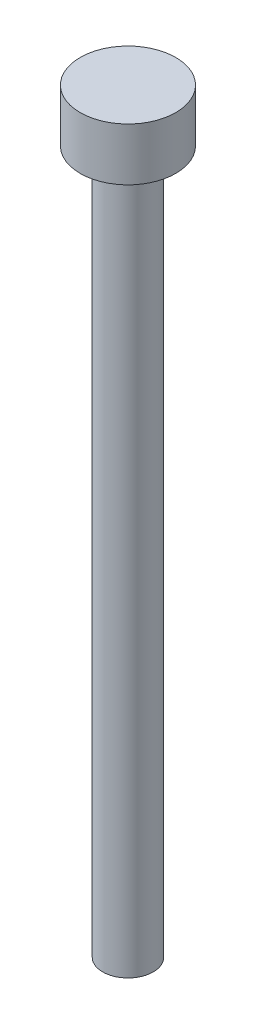
ISO-10303-21;
HEADER;
FILE_DESCRIPTION(('STEP AP214'),'2;1');
FILE_NAME('part.step','',(''),(''),'','','');
FILE_SCHEMA(('AUTOMOTIVE_DESIGN { 1 0 10303 214 1 1 1 1 }'));
ENDSEC;
DATA;
#1=APPLICATION_CONTEXT('core data for automotive mechanical design processes');
#2=APPLICATION_PROTOCOL_DEFINITION('international standard','automotive_design',2000,#1);
#3=PRODUCT_CONTEXT('',#1,'mechanical');
#4=PRODUCT('Part','Part','',(#3));
#5=PRODUCT_RELATED_PRODUCT_CATEGORY('part','',(#4));
#6=PRODUCT_DEFINITION_FORMATION('','',#4);
#7=PRODUCT_DEFINITION_CONTEXT('part definition',#1,'design');
#8=PRODUCT_DEFINITION('design','',#6,#7);
#9=PRODUCT_DEFINITION_SHAPE('','',#8);
#10=(LENGTH_UNIT() NAMED_UNIT(*) SI_UNIT(.MILLI.,.METRE.));
#11=(NAMED_UNIT(*) PLANE_ANGLE_UNIT() SI_UNIT($,.RADIAN.));
#12=(NAMED_UNIT(*) SI_UNIT($,.STERADIAN.) SOLID_ANGLE_UNIT());
#13=UNCERTAINTY_MEASURE_WITH_UNIT(LENGTH_MEASURE(1.E-05),#10,'distance_accuracy_value','');
#14=(GEOMETRIC_REPRESENTATION_CONTEXT(3) GLOBAL_UNCERTAINTY_ASSIGNED_CONTEXT((#13)) GLOBAL_UNIT_ASSIGNED_CONTEXT((#10,
#11,#12)) REPRESENTATION_CONTEXT('',''));
#15=CARTESIAN_POINT('',(0.,0.,0.));
#16=DIRECTION('',(0.,0.,1.));
#17=DIRECTION('',(1.,0.,0.));
#18=AXIS2_PLACEMENT_3D('',#15,#16,#17);
#19=CARTESIAN_POINT('',(0.,3.,0.));
#20=DIRECTION('',(0.,-1.,0.));
#21=DIRECTION('',(0.,0.,-1.));
#22=AXIS2_PLACEMENT_3D('',#19,#20,#21);
#23=CYLINDRICAL_SURFACE('',#22,2.72);
#24=CARTESIAN_POINT('',(0.,3.,0.));
#25=DIRECTION('',(0.,1.,0.));
#26=DIRECTION('',(0.,0.,1.));
#27=AXIS2_PLACEMENT_3D('',#24,#25,#26);
#28=CIRCLE('',#27,2.72);
#29=CARTESIAN_POINT('',(0.,3.,2.72));
#30=VERTEX_POINT('',#29);
#31=EDGE_CURVE('E45',#30,#30,#28,.T.);
#32=ORIENTED_EDGE('',*,*,#31,.F.);
#33=EDGE_LOOP('',(#32));
#34=FACE_BOUND('',#33,.T.);
#35=CARTESIAN_POINT('',(0.,0.,0.));
#36=DIRECTION('',(0.,1.,0.));
#37=DIRECTION('',(0.,0.,1.));
#38=AXIS2_PLACEMENT_3D('',#35,#36,#37);
#39=CIRCLE('',#38,2.72);
#40=CARTESIAN_POINT('',(0.,0.,2.72));
#41=VERTEX_POINT('',#40);
#42=EDGE_CURVE('E40',#41,#41,#39,.T.);
#43=ORIENTED_EDGE('',*,*,#42,.T.);
#44=EDGE_LOOP('',(#43));
#45=FACE_BOUND('',#44,.T.);
#46=ADVANCED_FACE('F37',(#34,#45),#23,.T.);
#47=CARTESIAN_POINT('',(0.,3.,0.));
#48=DIRECTION('',(0.,1.,0.));
#49=DIRECTION('',(0.,0.,1.));
#50=AXIS2_PLACEMENT_3D('',#47,#48,#49);
#51=PLANE('',#50);
#52=ORIENTED_EDGE('',*,*,#31,.T.);
#53=EDGE_LOOP('',(#52));
#54=FACE_BOUND('',#53,.T.);
#55=ADVANCED_FACE('F65',(#54),#51,.T.);
#56=CARTESIAN_POINT('',(0.,0.,0.));
#57=DIRECTION('',(0.,1.,0.));
#58=DIRECTION('',(0.,0.,1.));
#59=AXIS2_PLACEMENT_3D('',#56,#57,#58);
#60=PLANE('',#59);
#61=CARTESIAN_POINT('',(0.,0.,0.));
#62=DIRECTION('',(0.,-1.,0.));
#63=DIRECTION('',(0.,0.,-1.));
#64=AXIS2_PLACEMENT_3D('',#61,#62,#63);
#65=CIRCLE('',#64,1.44);
#66=CARTESIAN_POINT('',(0.,0.,-1.44));
#67=VERTEX_POINT('',#66);
#68=EDGE_CURVE('E10',#67,#67,#65,.T.);
#69=ORIENTED_EDGE('',*,*,#68,.F.);
#70=EDGE_LOOP('',(#69));
#71=FACE_BOUND('',#70,.T.);
#72=ORIENTED_EDGE('',*,*,#42,.F.);
#73=EDGE_LOOP('',(#72));
#74=FACE_BOUND('',#73,.T.);
#75=ADVANCED_FACE('F62',(#71,#74),#60,.F.);
#76=CARTESIAN_POINT('',(0.,-40.,0.));
#77=DIRECTION('',(0.,1.,0.));
#78=DIRECTION('',(0.,0.,1.));
#79=AXIS2_PLACEMENT_3D('',#76,#77,#78);
#80=CYLINDRICAL_SURFACE('',#79,1.44);
#81=CARTESIAN_POINT('',(0.,-40.,0.));
#82=DIRECTION('',(0.,-1.,0.));
#83=DIRECTION('',(0.,0.,-1.));
#84=AXIS2_PLACEMENT_3D('',#81,#82,#83);
#85=CIRCLE('',#84,1.44);
#86=CARTESIAN_POINT('',(0.,-40.,-1.44));
#87=VERTEX_POINT('',#86);
#88=EDGE_CURVE('E52',#87,#87,#85,.T.);
#89=ORIENTED_EDGE('',*,*,#88,.F.);
#90=EDGE_LOOP('',(#89));
#91=FACE_BOUND('',#90,.T.);
#92=ORIENTED_EDGE('',*,*,#68,.T.);
#93=EDGE_LOOP('',(#92));
#94=FACE_BOUND('',#93,.T.);
#95=ADVANCED_FACE('F64',(#91,#94),#80,.T.);
#96=CARTESIAN_POINT('',(0.,-40.,0.));
#97=DIRECTION('',(0.,-1.,0.));
#98=DIRECTION('',(0.,0.,-1.));
#99=AXIS2_PLACEMENT_3D('',#96,#97,#98);
#100=PLANE('',#99);
#101=ORIENTED_EDGE('',*,*,#88,.T.);
#102=EDGE_LOOP('',(#101));
#103=FACE_BOUND('',#102,.T.);
#104=ADVANCED_FACE('F71',(#103),#100,.T.);
#105=CLOSED_SHELL('',(#46,#55,#75,#95,#104));
#106=MANIFOLD_SOLID_BREP('B2',#105);
#107=ADVANCED_BREP_SHAPE_REPRESENTATION('',(#18,#106),#14);
#108=SHAPE_DEFINITION_REPRESENTATION(#9,#107);
ENDSEC;
END-ISO-10303-21;
